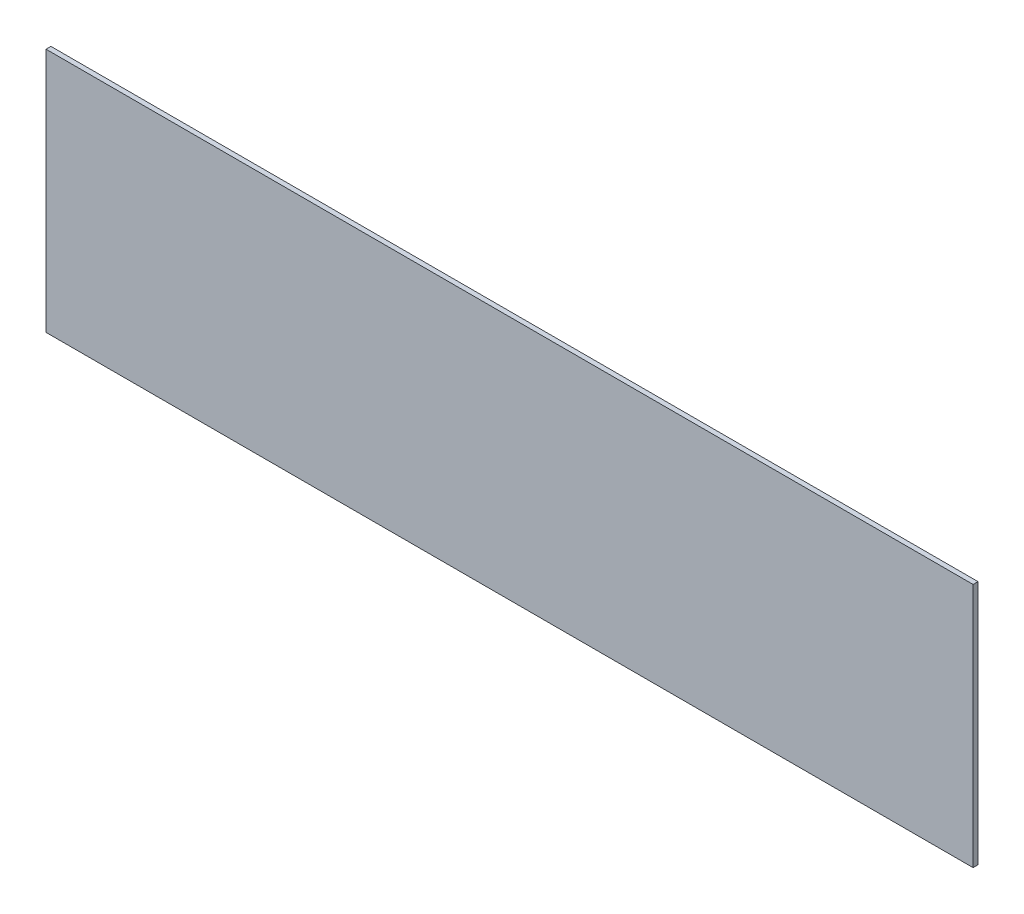
ISO-10303-21;
HEADER;
FILE_DESCRIPTION(('STEP AP214'),'2;1');
FILE_NAME('part.step','',(''),(''),'','','');
FILE_SCHEMA(('AUTOMOTIVE_DESIGN { 1 0 10303 214 1 1 1 1 }'));
ENDSEC;
DATA;
#1=APPLICATION_CONTEXT('core data for automotive mechanical design processes');
#2=APPLICATION_PROTOCOL_DEFINITION('international standard','automotive_design',2000,#1);
#3=PRODUCT_CONTEXT('',#1,'mechanical');
#4=PRODUCT('Part','Part','',(#3));
#5=PRODUCT_RELATED_PRODUCT_CATEGORY('part','',(#4));
#6=PRODUCT_DEFINITION_FORMATION('','',#4);
#7=PRODUCT_DEFINITION_CONTEXT('part definition',#1,'design');
#8=PRODUCT_DEFINITION('design','',#6,#7);
#9=PRODUCT_DEFINITION_SHAPE('','',#8);
#10=(LENGTH_UNIT() NAMED_UNIT(*) SI_UNIT(.MILLI.,.METRE.));
#11=(NAMED_UNIT(*) PLANE_ANGLE_UNIT() SI_UNIT($,.RADIAN.));
#12=(NAMED_UNIT(*) SI_UNIT($,.STERADIAN.) SOLID_ANGLE_UNIT());
#13=UNCERTAINTY_MEASURE_WITH_UNIT(LENGTH_MEASURE(1.E-05),#10,'distance_accuracy_value','');
#14=(GEOMETRIC_REPRESENTATION_CONTEXT(3) GLOBAL_UNCERTAINTY_ASSIGNED_CONTEXT((#13)) GLOBAL_UNIT_ASSIGNED_CONTEXT((#10,
#11,#12)) REPRESENTATION_CONTEXT('',''));
#15=CARTESIAN_POINT('',(0.,0.,0.));
#16=DIRECTION('',(0.,0.,1.));
#17=DIRECTION('',(1.,0.,0.));
#18=AXIS2_PLACEMENT_3D('',#15,#16,#17);
#19=CARTESIAN_POINT('',(-62.1494525927915,56.9228524070013,1.));
#20=DIRECTION('',(1.,0.,0.));
#21=DIRECTION('',(0.,0.,-1.));
#22=AXIS2_PLACEMENT_3D('',#19,#20,#21);
#23=PLANE('',#22);
#24=DIRECTION('',(0.,-1.,0.));
#25=VECTOR('',#24,1.);
#26=CARTESIAN_POINT('',(-62.1494525927915,56.9228524070013,0.));
#27=LINE('',#26,#25);
#28=CARTESIAN_POINT('',(-62.1494525927915,56.9228524070013,0.));
#29=VERTEX_POINT('',#28);
#30=CARTESIAN_POINT('',(-62.1494525927915,6.9228524070013,0.));
#31=VERTEX_POINT('',#30);
#32=EDGE_CURVE('E96',#29,#31,#27,.T.);
#33=ORIENTED_EDGE('',*,*,#32,.T.);
#34=DIRECTION('',(0.,0.,-1.));
#35=VECTOR('',#34,1.);
#36=CARTESIAN_POINT('',(-62.1494525927915,6.9228524070013,1.));
#37=LINE('',#36,#35);
#38=CARTESIAN_POINT('',(-62.1494525927915,6.9228524070013,1.));
#39=VERTEX_POINT('',#38);
#40=EDGE_CURVE('E11',#39,#31,#37,.T.);
#41=ORIENTED_EDGE('',*,*,#40,.F.);
#42=DIRECTION('',(0.,-1.,0.));
#43=VECTOR('',#42,1.);
#44=CARTESIAN_POINT('',(-62.1494525927915,56.9228524070013,1.));
#45=LINE('',#44,#43);
#46=CARTESIAN_POINT('',(-62.1494525927915,56.9228524070013,1.));
#47=VERTEX_POINT('',#46);
#48=EDGE_CURVE('E84',#47,#39,#45,.T.);
#49=ORIENTED_EDGE('',*,*,#48,.F.);
#50=DIRECTION('',(0.,0.,-1.));
#51=VECTOR('',#50,1.);
#52=CARTESIAN_POINT('',(-62.1494525927915,56.9228524070013,1.));
#53=LINE('',#52,#51);
#54=EDGE_CURVE('E92',#47,#29,#53,.T.);
#55=ORIENTED_EDGE('',*,*,#54,.T.);
#56=EDGE_LOOP('',(#33,#41,#49,#55));
#57=FACE_BOUND('',#56,.T.);
#58=ADVANCED_FACE('F33',(#57),#23,.F.);
#59=CARTESIAN_POINT('',(-62.1494525927915,6.9228524070013,1.));
#60=DIRECTION('',(0.,1.,0.));
#61=DIRECTION('',(0.,0.,1.));
#62=AXIS2_PLACEMENT_3D('',#59,#60,#61);
#63=PLANE('',#62);
#64=DIRECTION('',(1.,0.,0.));
#65=VECTOR('',#64,1.);
#66=CARTESIAN_POINT('',(-62.1494525927915,6.9228524070013,0.));
#67=LINE('',#66,#65);
#68=CARTESIAN_POINT('',(126.850547407209,6.9228524070013,0.));
#69=VERTEX_POINT('',#68);
#70=EDGE_CURVE('E88',#31,#69,#67,.T.);
#71=ORIENTED_EDGE('',*,*,#70,.T.);
#72=DIRECTION('',(0.,0.,-1.));
#73=VECTOR('',#72,1.);
#74=CARTESIAN_POINT('',(126.850547407209,6.9228524070013,1.));
#75=LINE('',#74,#73);
#76=CARTESIAN_POINT('',(126.850547407209,6.9228524070013,1.));
#77=VERTEX_POINT('',#76);
#78=EDGE_CURVE('E41',#77,#69,#75,.T.);
#79=ORIENTED_EDGE('',*,*,#78,.F.);
#80=DIRECTION('',(1.,0.,0.));
#81=VECTOR('',#80,1.);
#82=CARTESIAN_POINT('',(-62.1494525927915,6.9228524070013,1.));
#83=LINE('',#82,#81);
#84=EDGE_CURVE('E79',#39,#77,#83,.T.);
#85=ORIENTED_EDGE('',*,*,#84,.F.);
#86=ORIENTED_EDGE('',*,*,#40,.T.);
#87=EDGE_LOOP('',(#71,#79,#85,#86));
#88=FACE_BOUND('',#87,.T.);
#89=ADVANCED_FACE('F87',(#88),#63,.F.);
#90=CARTESIAN_POINT('',(126.850547407209,56.9228524070013,1.));
#91=DIRECTION('',(-1.,0.,0.));
#92=DIRECTION('',(0.,0.,1.));
#93=AXIS2_PLACEMENT_3D('',#90,#91,#92);
#94=PLANE('',#93);
#95=DIRECTION('',(0.,1.,0.));
#96=VECTOR('',#95,1.);
#97=CARTESIAN_POINT('',(126.850547407209,56.9228524070013,0.));
#98=LINE('',#97,#96);
#99=CARTESIAN_POINT('',(126.850547407209,56.9228524070013,0.));
#100=VERTEX_POINT('',#99);
#101=EDGE_CURVE('E66',#69,#100,#98,.T.);
#102=ORIENTED_EDGE('',*,*,#101,.T.);
#103=DIRECTION('',(0.,0.,-1.));
#104=VECTOR('',#103,1.);
#105=CARTESIAN_POINT('',(126.850547407209,56.9228524070013,1.));
#106=LINE('',#105,#104);
#107=CARTESIAN_POINT('',(126.850547407209,56.9228524070013,1.));
#108=VERTEX_POINT('',#107);
#109=EDGE_CURVE('E89',#108,#100,#106,.T.);
#110=ORIENTED_EDGE('',*,*,#109,.F.);
#111=DIRECTION('',(0.,1.,0.));
#112=VECTOR('',#111,1.);
#113=CARTESIAN_POINT('',(126.850547407209,56.9228524070013,1.));
#114=LINE('',#113,#112);
#115=EDGE_CURVE('E82',#77,#108,#114,.T.);
#116=ORIENTED_EDGE('',*,*,#115,.F.);
#117=ORIENTED_EDGE('',*,*,#78,.T.);
#118=EDGE_LOOP('',(#102,#110,#116,#117));
#119=FACE_BOUND('',#118,.T.);
#120=ADVANCED_FACE('F90',(#119),#94,.F.);
#121=CARTESIAN_POINT('',(-62.1494525927915,56.9228524070013,1.));
#122=DIRECTION('',(0.,-1.,0.));
#123=DIRECTION('',(0.,0.,-1.));
#124=AXIS2_PLACEMENT_3D('',#121,#122,#123);
#125=PLANE('',#124);
#126=DIRECTION('',(-1.,0.,0.));
#127=VECTOR('',#126,1.);
#128=CARTESIAN_POINT('',(-62.1494525927915,56.9228524070013,0.));
#129=LINE('',#128,#127);
#130=EDGE_CURVE('E72',#100,#29,#129,.T.);
#131=ORIENTED_EDGE('',*,*,#130,.T.);
#132=ORIENTED_EDGE('',*,*,#54,.F.);
#133=DIRECTION('',(-1.,0.,0.));
#134=VECTOR('',#133,1.);
#135=CARTESIAN_POINT('',(-62.1494525927915,56.9228524070013,1.));
#136=LINE('',#135,#134);
#137=EDGE_CURVE('E49',#108,#47,#136,.T.);
#138=ORIENTED_EDGE('',*,*,#137,.F.);
#139=ORIENTED_EDGE('',*,*,#109,.T.);
#140=EDGE_LOOP('',(#131,#132,#138,#139));
#141=FACE_BOUND('',#140,.T.);
#142=ADVANCED_FACE('F103',(#141),#125,.F.);
#143=CARTESIAN_POINT('',(-62.1494525927915,6.9228524070013,1.));
#144=DIRECTION('',(0.,0.,1.));
#145=DIRECTION('',(1.,0.,0.));
#146=AXIS2_PLACEMENT_3D('',#143,#144,#145);
#147=PLANE('',#146);
#148=ORIENTED_EDGE('',*,*,#48,.T.);
#149=ORIENTED_EDGE('',*,*,#84,.T.);
#150=ORIENTED_EDGE('',*,*,#115,.T.);
#151=ORIENTED_EDGE('',*,*,#137,.T.);
#152=EDGE_LOOP('',(#148,#149,#150,#151));
#153=FACE_BOUND('',#152,.T.);
#154=ADVANCED_FACE('F80',(#153),#147,.T.);
#155=CARTESIAN_POINT('',(-62.1494525927915,6.9228524070013,0.));
#156=DIRECTION('',(0.,0.,1.));
#157=DIRECTION('',(1.,0.,0.));
#158=AXIS2_PLACEMENT_3D('',#155,#156,#157);
#159=PLANE('',#158);
#160=ORIENTED_EDGE('',*,*,#32,.F.);
#161=ORIENTED_EDGE('',*,*,#130,.F.);
#162=ORIENTED_EDGE('',*,*,#101,.F.);
#163=ORIENTED_EDGE('',*,*,#70,.F.);
#164=EDGE_LOOP('',(#160,#161,#162,#163));
#165=FACE_BOUND('',#164,.T.);
#166=ADVANCED_FACE('F106',(#165),#159,.F.);
#167=CLOSED_SHELL('',(#58,#89,#120,#142,#154,#166));
#168=MANIFOLD_SOLID_BREP('B2',#167);
#169=ADVANCED_BREP_SHAPE_REPRESENTATION('',(#18,#168),#14);
#170=SHAPE_DEFINITION_REPRESENTATION(#9,#169);
ENDSEC;
END-ISO-10303-21;
